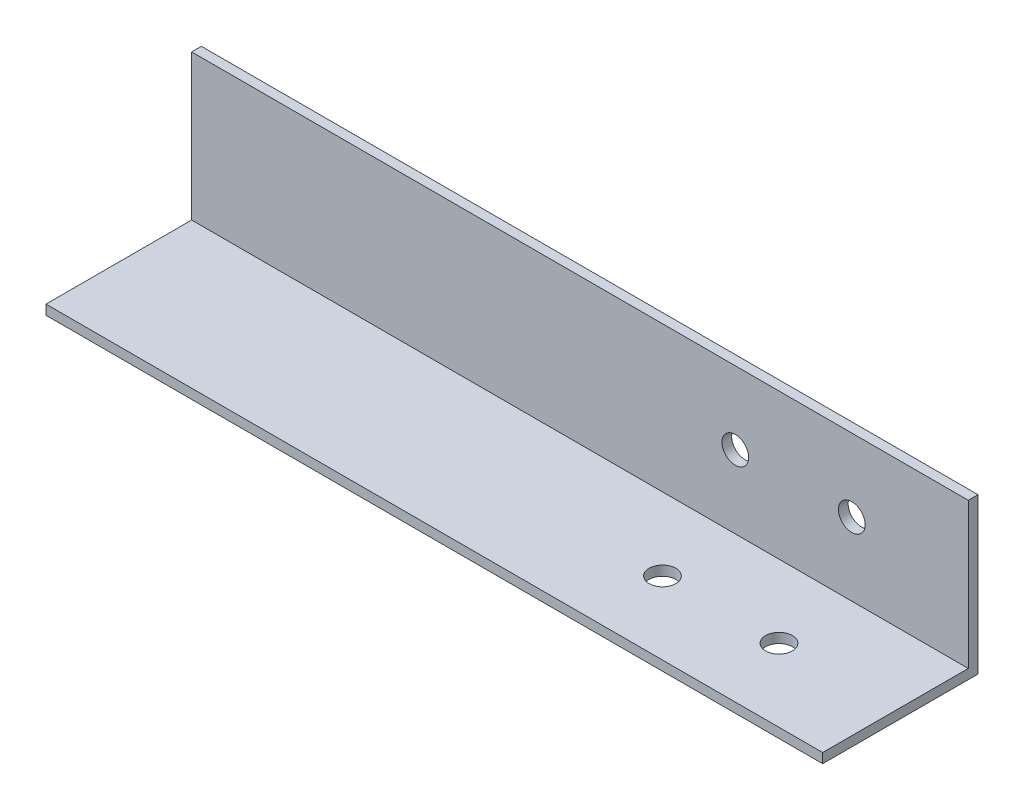
ISO-10303-21;
HEADER;
FILE_DESCRIPTION(('STEP AP214'),'2;1');
FILE_NAME('part.step','',(''),(''),'','','');
FILE_SCHEMA(('AUTOMOTIVE_DESIGN { 1 0 10303 214 1 1 1 1 }'));
ENDSEC;
DATA;
#1=APPLICATION_CONTEXT('core data for automotive mechanical design processes');
#2=APPLICATION_PROTOCOL_DEFINITION('international standard','automotive_design',2000,#1);
#3=PRODUCT_CONTEXT('',#1,'mechanical');
#4=PRODUCT('Part','Part','',(#3));
#5=PRODUCT_RELATED_PRODUCT_CATEGORY('part','',(#4));
#6=PRODUCT_DEFINITION_FORMATION('','',#4);
#7=PRODUCT_DEFINITION_CONTEXT('part definition',#1,'design');
#8=PRODUCT_DEFINITION('design','',#6,#7);
#9=PRODUCT_DEFINITION_SHAPE('','',#8);
#10=(LENGTH_UNIT() NAMED_UNIT(*) SI_UNIT(.MILLI.,.METRE.));
#11=(NAMED_UNIT(*) PLANE_ANGLE_UNIT() SI_UNIT($,.RADIAN.));
#12=(NAMED_UNIT(*) SI_UNIT($,.STERADIAN.) SOLID_ANGLE_UNIT());
#13=UNCERTAINTY_MEASURE_WITH_UNIT(LENGTH_MEASURE(1.E-05),#10,'distance_accuracy_value','');
#14=(GEOMETRIC_REPRESENTATION_CONTEXT(3) GLOBAL_UNCERTAINTY_ASSIGNED_CONTEXT((#13)) GLOBAL_UNIT_ASSIGNED_CONTEXT((#10,
#11,#12)) REPRESENTATION_CONTEXT('',''));
#15=CARTESIAN_POINT('',(0.,0.,0.));
#16=DIRECTION('',(0.,0.,1.));
#17=DIRECTION('',(1.,0.,0.));
#18=AXIS2_PLACEMENT_3D('',#15,#16,#17);
#19=CARTESIAN_POINT('',(254.,47.625,0.));
#20=DIRECTION('',(0.,-1.,0.));
#21=DIRECTION('',(0.,0.,-1.));
#22=AXIS2_PLACEMENT_3D('',#19,#20,#21);
#23=PLANE('',#22);
#24=DIRECTION('',(0.,0.,1.));
#25=VECTOR('',#24,1.);
#26=CARTESIAN_POINT('',(0.,47.625,0.));
#27=LINE('',#26,#25);
#28=CARTESIAN_POINT('',(0.,47.625,0.));
#29=VERTEX_POINT('',#28);
#30=CARTESIAN_POINT('',(0.,47.625,3.175));
#31=VERTEX_POINT('',#30);
#32=EDGE_CURVE('E120',#29,#31,#27,.T.);
#33=ORIENTED_EDGE('',*,*,#32,.T.);
#34=DIRECTION('',(-1.,0.,0.));
#35=VECTOR('',#34,1.);
#36=CARTESIAN_POINT('',(254.,47.625,3.175));
#37=LINE('',#36,#35);
#38=CARTESIAN_POINT('',(254.,47.625,3.175));
#39=VERTEX_POINT('',#38);
#40=EDGE_CURVE('E40',#39,#31,#37,.T.);
#41=ORIENTED_EDGE('',*,*,#40,.F.);
#42=DIRECTION('',(0.,0.,1.));
#43=VECTOR('',#42,1.);
#44=CARTESIAN_POINT('',(254.,47.625,0.));
#45=LINE('',#44,#43);
#46=CARTESIAN_POINT('',(254.,47.625,0.));
#47=VERTEX_POINT('',#46);
#48=EDGE_CURVE('E86',#47,#39,#45,.T.);
#49=ORIENTED_EDGE('',*,*,#48,.F.);
#50=DIRECTION('',(-1.,0.,0.));
#51=VECTOR('',#50,1.);
#52=CARTESIAN_POINT('',(254.,47.625,0.));
#53=LINE('',#52,#51);
#54=EDGE_CURVE('E11',#47,#29,#53,.T.);
#55=ORIENTED_EDGE('',*,*,#54,.T.);
#56=EDGE_LOOP('',(#33,#41,#49,#55));
#57=FACE_BOUND('',#56,.T.);
#58=ADVANCED_FACE('F32',(#57),#23,.F.);
#59=CARTESIAN_POINT('',(254.,0.,3.175));
#60=DIRECTION('',(0.,0.,-1.));
#61=DIRECTION('',(-1.,0.,0.));
#62=AXIS2_PLACEMENT_3D('',#59,#60,#61);
#63=PLANE('',#62);
#64=CARTESIAN_POINT('',(177.8,23.8125,3.175));
#65=DIRECTION('',(0.,0.,1.));
#66=DIRECTION('',(1.,0.,0.));
#67=AXIS2_PLACEMENT_3D('',#64,#65,#66);
#68=CIRCLE('',#67,4.365625);
#69=CARTESIAN_POINT('',(182.165625,23.8125,3.175));
#70=VERTEX_POINT('',#69);
#71=EDGE_CURVE('E148',#70,#70,#68,.T.);
#72=ORIENTED_EDGE('',*,*,#71,.F.);
#73=EDGE_LOOP('',(#72));
#74=FACE_BOUND('',#73,.T.);
#75=CARTESIAN_POINT('',(215.9,23.8125,3.175));
#76=DIRECTION('',(0.,0.,1.));
#77=DIRECTION('',(1.,0.,0.));
#78=AXIS2_PLACEMENT_3D('',#75,#76,#77);
#79=CIRCLE('',#78,4.365625);
#80=CARTESIAN_POINT('',(220.265625,23.8125,3.175));
#81=VERTEX_POINT('',#80);
#82=EDGE_CURVE('E149',#81,#81,#79,.T.);
#83=ORIENTED_EDGE('',*,*,#82,.F.);
#84=EDGE_LOOP('',(#83));
#85=FACE_BOUND('',#84,.T.);
#86=DIRECTION('',(0.,-1.,0.));
#87=VECTOR('',#86,1.);
#88=CARTESIAN_POINT('',(0.,0.,3.175));
#89=LINE('',#88,#87);
#90=CARTESIAN_POINT('',(0.,0.,3.175));
#91=VERTEX_POINT('',#90);
#92=EDGE_CURVE('E122',#31,#91,#89,.T.);
#93=ORIENTED_EDGE('',*,*,#92,.T.);
#94=DIRECTION('',(-1.,0.,0.));
#95=VECTOR('',#94,1.);
#96=CARTESIAN_POINT('',(254.,0.,3.175));
#97=LINE('',#96,#95);
#98=CARTESIAN_POINT('',(254.,0.,3.175));
#99=VERTEX_POINT('',#98);
#100=EDGE_CURVE('E109',#99,#91,#97,.T.);
#101=ORIENTED_EDGE('',*,*,#100,.F.);
#102=DIRECTION('',(0.,-1.,0.));
#103=VECTOR('',#102,1.);
#104=CARTESIAN_POINT('',(254.,0.,3.175));
#105=LINE('',#104,#103);
#106=EDGE_CURVE('E100',#39,#99,#105,.T.);
#107=ORIENTED_EDGE('',*,*,#106,.F.);
#108=ORIENTED_EDGE('',*,*,#40,.T.);
#109=EDGE_LOOP('',(#93,#101,#107,#108));
#110=FACE_BOUND('',#109,.T.);
#111=ADVANCED_FACE('F135',(#74,#85,#110),#63,.F.);
#112=CARTESIAN_POINT('',(254.,0.,3.175));
#113=DIRECTION('',(0.,-1.,0.));
#114=DIRECTION('',(0.,0.,-1.));
#115=AXIS2_PLACEMENT_3D('',#112,#113,#114);
#116=PLANE('',#115);
#117=CARTESIAN_POINT('',(177.8,0.,26.9875));
#118=DIRECTION('',(0.,1.,0.));
#119=DIRECTION('',(0.,0.,1.));
#120=AXIS2_PLACEMENT_3D('',#117,#118,#119);
#121=CIRCLE('',#120,4.365625);
#122=CARTESIAN_POINT('',(177.8,0.,31.353125));
#123=VERTEX_POINT('',#122);
#124=EDGE_CURVE('E160',#123,#123,#121,.T.);
#125=ORIENTED_EDGE('',*,*,#124,.F.);
#126=EDGE_LOOP('',(#125));
#127=FACE_BOUND('',#126,.T.);
#128=CARTESIAN_POINT('',(215.9,0.,26.9875));
#129=DIRECTION('',(0.,1.,0.));
#130=DIRECTION('',(0.,0.,1.));
#131=AXIS2_PLACEMENT_3D('',#128,#129,#130);
#132=CIRCLE('',#131,4.365625);
#133=CARTESIAN_POINT('',(215.9,0.,31.353125));
#134=VERTEX_POINT('',#133);
#135=EDGE_CURVE('E161',#134,#134,#132,.T.);
#136=ORIENTED_EDGE('',*,*,#135,.F.);
#137=EDGE_LOOP('',(#136));
#138=FACE_BOUND('',#137,.T.);
#139=DIRECTION('',(0.,0.,1.));
#140=VECTOR('',#139,1.);
#141=CARTESIAN_POINT('',(0.,0.,3.175));
#142=LINE('',#141,#140);
#143=CARTESIAN_POINT('',(0.,0.,50.8));
#144=VERTEX_POINT('',#143);
#145=EDGE_CURVE('E108',#91,#144,#142,.T.);
#146=ORIENTED_EDGE('',*,*,#145,.T.);
#147=DIRECTION('',(-1.,0.,0.));
#148=VECTOR('',#147,1.);
#149=CARTESIAN_POINT('',(254.,0.,50.8));
#150=LINE('',#149,#148);
#151=CARTESIAN_POINT('',(254.,0.,50.8));
#152=VERTEX_POINT('',#151);
#153=EDGE_CURVE('E105',#152,#144,#150,.T.);
#154=ORIENTED_EDGE('',*,*,#153,.F.);
#155=DIRECTION('',(0.,0.,1.));
#156=VECTOR('',#155,1.);
#157=CARTESIAN_POINT('',(254.,0.,3.175));
#158=LINE('',#157,#156);
#159=EDGE_CURVE('E94',#99,#152,#158,.T.);
#160=ORIENTED_EDGE('',*,*,#159,.F.);
#161=ORIENTED_EDGE('',*,*,#100,.T.);
#162=EDGE_LOOP('',(#146,#154,#160,#161));
#163=FACE_BOUND('',#162,.T.);
#164=ADVANCED_FACE('F106',(#127,#138,#163),#116,.F.);
#165=CARTESIAN_POINT('',(254.,0.,50.8));
#166=DIRECTION('',(0.,0.,-1.));
#167=DIRECTION('',(-1.,0.,0.));
#168=AXIS2_PLACEMENT_3D('',#165,#166,#167);
#169=PLANE('',#168);
#170=DIRECTION('',(0.,-1.,0.));
#171=VECTOR('',#170,1.);
#172=CARTESIAN_POINT('',(0.,0.,50.8));
#173=LINE('',#172,#171);
#174=CARTESIAN_POINT('',(0.,-3.175,50.8));
#175=VERTEX_POINT('',#174);
#176=EDGE_CURVE('E72',#144,#175,#173,.T.);
#177=ORIENTED_EDGE('',*,*,#176,.T.);
#178=DIRECTION('',(-1.,0.,0.));
#179=VECTOR('',#178,1.);
#180=CARTESIAN_POINT('',(254.,-3.175,50.8));
#181=LINE('',#180,#179);
#182=CARTESIAN_POINT('',(254.,-3.175,50.8));
#183=VERTEX_POINT('',#182);
#184=EDGE_CURVE('E110',#183,#175,#181,.T.);
#185=ORIENTED_EDGE('',*,*,#184,.F.);
#186=DIRECTION('',(0.,-1.,0.));
#187=VECTOR('',#186,1.);
#188=CARTESIAN_POINT('',(254.,0.,50.8));
#189=LINE('',#188,#187);
#190=EDGE_CURVE('E98',#152,#183,#189,.T.);
#191=ORIENTED_EDGE('',*,*,#190,.F.);
#192=ORIENTED_EDGE('',*,*,#153,.T.);
#193=EDGE_LOOP('',(#177,#185,#191,#192));
#194=FACE_BOUND('',#193,.T.);
#195=ADVANCED_FACE('F112',(#194),#169,.F.);
#196=CARTESIAN_POINT('',(254.,-3.175,0.));
#197=DIRECTION('',(0.,1.,0.));
#198=DIRECTION('',(0.,0.,1.));
#199=AXIS2_PLACEMENT_3D('',#196,#197,#198);
#200=PLANE('',#199);
#201=CARTESIAN_POINT('',(177.8,-3.175,26.9875));
#202=DIRECTION('',(0.,1.,0.));
#203=DIRECTION('',(0.,0.,1.));
#204=AXIS2_PLACEMENT_3D('',#201,#202,#203);
#205=CIRCLE('',#204,4.365625);
#206=CARTESIAN_POINT('',(177.8,-3.175,31.353125));
#207=VERTEX_POINT('',#206);
#208=EDGE_CURVE('E152',#207,#207,#205,.F.);
#209=ORIENTED_EDGE('',*,*,#208,.F.);
#210=EDGE_LOOP('',(#209));
#211=FACE_BOUND('',#210,.T.);
#212=CARTESIAN_POINT('',(215.9,-3.175,26.9875));
#213=DIRECTION('',(0.,1.,0.));
#214=DIRECTION('',(0.,0.,1.));
#215=AXIS2_PLACEMENT_3D('',#212,#213,#214);
#216=CIRCLE('',#215,4.365625);
#217=CARTESIAN_POINT('',(215.9,-3.175,31.353125));
#218=VERTEX_POINT('',#217);
#219=EDGE_CURVE('E157',#218,#218,#216,.F.);
#220=ORIENTED_EDGE('',*,*,#219,.F.);
#221=EDGE_LOOP('',(#220));
#222=FACE_BOUND('',#221,.T.);
#223=DIRECTION('',(0.,0.,-1.));
#224=VECTOR('',#223,1.);
#225=CARTESIAN_POINT('',(0.,-3.175,0.));
#226=LINE('',#225,#224);
#227=CARTESIAN_POINT('',(0.,-3.175,0.));
#228=VERTEX_POINT('',#227);
#229=EDGE_CURVE('E79',#175,#228,#226,.T.);
#230=ORIENTED_EDGE('',*,*,#229,.T.);
#231=DIRECTION('',(-1.,0.,0.));
#232=VECTOR('',#231,1.);
#233=CARTESIAN_POINT('',(254.,-3.175,0.));
#234=LINE('',#233,#232);
#235=CARTESIAN_POINT('',(254.,-3.175,0.));
#236=VERTEX_POINT('',#235);
#237=EDGE_CURVE('E116',#236,#228,#234,.T.);
#238=ORIENTED_EDGE('',*,*,#237,.F.);
#239=DIRECTION('',(0.,0.,-1.));
#240=VECTOR('',#239,1.);
#241=CARTESIAN_POINT('',(254.,-3.175,0.));
#242=LINE('',#241,#240);
#243=EDGE_CURVE('E114',#183,#236,#242,.T.);
#244=ORIENTED_EDGE('',*,*,#243,.F.);
#245=ORIENTED_EDGE('',*,*,#184,.T.);
#246=EDGE_LOOP('',(#230,#238,#244,#245));
#247=FACE_BOUND('',#246,.T.);
#248=ADVANCED_FACE('F141',(#211,#222,#247),#200,.F.);
#249=CARTESIAN_POINT('',(254.,0.,0.));
#250=DIRECTION('',(0.,0.,1.));
#251=DIRECTION('',(1.,0.,0.));
#252=AXIS2_PLACEMENT_3D('',#249,#250,#251);
#253=PLANE('',#252);
#254=CARTESIAN_POINT('',(177.8,23.8125,0.));
#255=DIRECTION('',(0.,0.,1.));
#256=DIRECTION('',(1.,0.,0.));
#257=AXIS2_PLACEMENT_3D('',#254,#255,#256);
#258=CIRCLE('',#257,4.365625);
#259=CARTESIAN_POINT('',(182.165625,23.8125,0.));
#260=VERTEX_POINT('',#259);
#261=EDGE_CURVE('E123',#260,#260,#258,.F.);
#262=ORIENTED_EDGE('',*,*,#261,.F.);
#263=EDGE_LOOP('',(#262));
#264=FACE_BOUND('',#263,.T.);
#265=CARTESIAN_POINT('',(215.9,23.8125,0.));
#266=DIRECTION('',(0.,0.,1.));
#267=DIRECTION('',(1.,0.,0.));
#268=AXIS2_PLACEMENT_3D('',#265,#266,#267);
#269=CIRCLE('',#268,4.365625);
#270=CARTESIAN_POINT('',(220.265625,23.8125,0.));
#271=VERTEX_POINT('',#270);
#272=EDGE_CURVE('E145',#271,#271,#269,.F.);
#273=ORIENTED_EDGE('',*,*,#272,.F.);
#274=EDGE_LOOP('',(#273));
#275=FACE_BOUND('',#274,.T.);
#276=DIRECTION('',(0.,1.,0.));
#277=VECTOR('',#276,1.);
#278=CARTESIAN_POINT('',(0.,0.,0.));
#279=LINE('',#278,#277);
#280=EDGE_CURVE('E128',#228,#29,#279,.T.);
#281=ORIENTED_EDGE('',*,*,#280,.T.);
#282=ORIENTED_EDGE('',*,*,#54,.F.);
#283=DIRECTION('',(0.,1.,0.));
#284=VECTOR('',#283,1.);
#285=CARTESIAN_POINT('',(254.,0.,0.));
#286=LINE('',#285,#284);
#287=EDGE_CURVE('E48',#236,#47,#286,.T.);
#288=ORIENTED_EDGE('',*,*,#287,.F.);
#289=ORIENTED_EDGE('',*,*,#237,.T.);
#290=EDGE_LOOP('',(#281,#282,#288,#289));
#291=FACE_BOUND('',#290,.T.);
#292=ADVANCED_FACE('F140',(#264,#275,#291),#253,.F.);
#293=CARTESIAN_POINT('',(254.,0.,0.));
#294=DIRECTION('',(1.,0.,0.));
#295=DIRECTION('',(0.,0.,-1.));
#296=AXIS2_PLACEMENT_3D('',#293,#294,#295);
#297=PLANE('',#296);
#298=ORIENTED_EDGE('',*,*,#287,.T.);
#299=ORIENTED_EDGE('',*,*,#48,.T.);
#300=ORIENTED_EDGE('',*,*,#106,.T.);
#301=ORIENTED_EDGE('',*,*,#159,.T.);
#302=ORIENTED_EDGE('',*,*,#190,.T.);
#303=ORIENTED_EDGE('',*,*,#243,.T.);
#304=EDGE_LOOP('',(#298,#299,#300,#301,#302,#303));
#305=FACE_BOUND('',#304,.T.);
#306=ADVANCED_FACE('F96',(#305),#297,.T.);
#307=CARTESIAN_POINT('',(0.,0.,0.));
#308=DIRECTION('',(1.,0.,0.));
#309=DIRECTION('',(0.,0.,-1.));
#310=AXIS2_PLACEMENT_3D('',#307,#308,#309);
#311=PLANE('',#310);
#312=ORIENTED_EDGE('',*,*,#32,.F.);
#313=ORIENTED_EDGE('',*,*,#280,.F.);
#314=ORIENTED_EDGE('',*,*,#229,.F.);
#315=ORIENTED_EDGE('',*,*,#176,.F.);
#316=ORIENTED_EDGE('',*,*,#145,.F.);
#317=ORIENTED_EDGE('',*,*,#92,.F.);
#318=EDGE_LOOP('',(#312,#313,#314,#315,#316,#317));
#319=FACE_BOUND('',#318,.T.);
#320=ADVANCED_FACE('F138',(#319),#311,.F.);
#321=CARTESIAN_POINT('',(215.9,23.8125,-12.3478521664701));
#322=DIRECTION('',(0.,0.,1.));
#323=DIRECTION('',(1.,0.,0.));
#324=AXIS2_PLACEMENT_3D('',#321,#322,#323);
#325=CYLINDRICAL_SURFACE('',#324,4.365625);
#326=ORIENTED_EDGE('',*,*,#272,.T.);
#327=EDGE_LOOP('',(#326));
#328=FACE_BOUND('',#327,.T.);
#329=ORIENTED_EDGE('',*,*,#82,.T.);
#330=EDGE_LOOP('',(#329));
#331=FACE_BOUND('',#330,.T.);
#332=ADVANCED_FACE('F187',(#328,#331),#325,.F.);
#333=CARTESIAN_POINT('',(177.8,23.8125,-12.3478521664701));
#334=DIRECTION('',(0.,0.,1.));
#335=DIRECTION('',(1.,0.,0.));
#336=AXIS2_PLACEMENT_3D('',#333,#334,#335);
#337=CYLINDRICAL_SURFACE('',#336,4.365625);
#338=ORIENTED_EDGE('',*,*,#261,.T.);
#339=EDGE_LOOP('',(#338));
#340=FACE_BOUND('',#339,.T.);
#341=ORIENTED_EDGE('',*,*,#71,.T.);
#342=EDGE_LOOP('',(#341));
#343=FACE_BOUND('',#342,.T.);
#344=ADVANCED_FACE('F178',(#340,#343),#337,.F.);
#345=CARTESIAN_POINT('',(215.9,-15.5228521664701,26.9875));
#346=DIRECTION('',(0.,1.,0.));
#347=DIRECTION('',(0.,0.,1.));
#348=AXIS2_PLACEMENT_3D('',#345,#346,#347);
#349=CYLINDRICAL_SURFACE('',#348,4.365625);
#350=ORIENTED_EDGE('',*,*,#219,.T.);
#351=EDGE_LOOP('',(#350));
#352=FACE_BOUND('',#351,.T.);
#353=ORIENTED_EDGE('',*,*,#135,.T.);
#354=EDGE_LOOP('',(#353));
#355=FACE_BOUND('',#354,.T.);
#356=ADVANCED_FACE('F176',(#352,#355),#349,.F.);
#357=CARTESIAN_POINT('',(177.8,-15.5228521664701,26.9875));
#358=DIRECTION('',(0.,1.,0.));
#359=DIRECTION('',(0.,0.,1.));
#360=AXIS2_PLACEMENT_3D('',#357,#358,#359);
#361=CYLINDRICAL_SURFACE('',#360,4.365625);
#362=ORIENTED_EDGE('',*,*,#208,.T.);
#363=EDGE_LOOP('',(#362));
#364=FACE_BOUND('',#363,.T.);
#365=ORIENTED_EDGE('',*,*,#124,.T.);
#366=EDGE_LOOP('',(#365));
#367=FACE_BOUND('',#366,.T.);
#368=ADVANCED_FACE('F169',(#364,#367),#361,.F.);
#369=CLOSED_SHELL('',(#58,#111,#164,#195,#248,#292,#306,#320,#332,#344,#356,#368));
#370=MANIFOLD_SOLID_BREP('B2',#369);
#371=ADVANCED_BREP_SHAPE_REPRESENTATION('',(#18,#370),#14);
#372=SHAPE_DEFINITION_REPRESENTATION(#9,#371);
ENDSEC;
END-ISO-10303-21;
